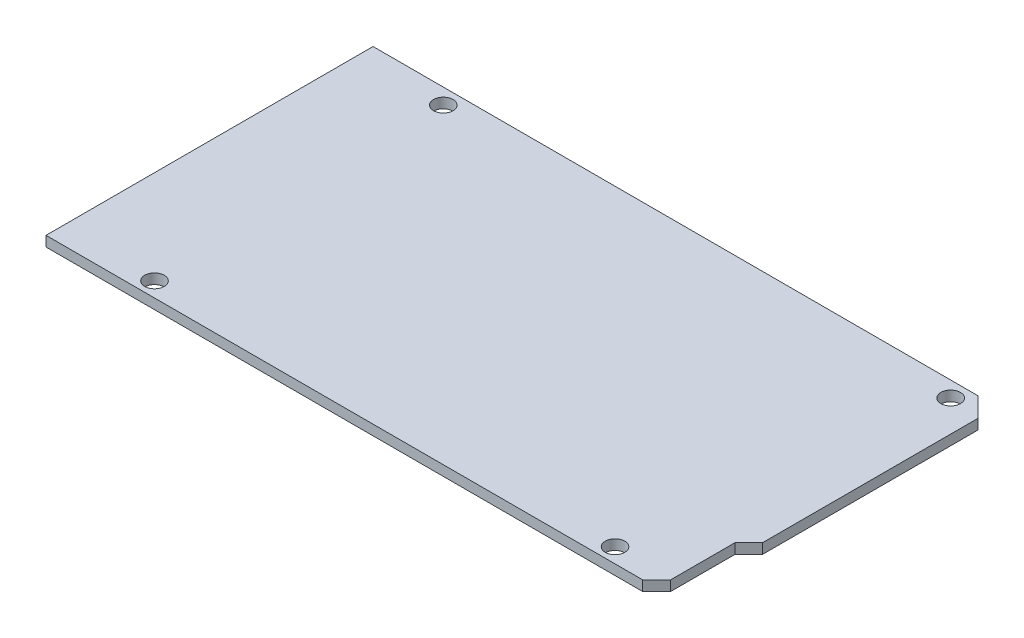
ISO-10303-21;
HEADER;
FILE_DESCRIPTION(('STEP AP214'),'2;1');
FILE_NAME('part.step','',(''),(''),'','','');
FILE_SCHEMA(('AUTOMOTIVE_DESIGN { 1 0 10303 214 1 1 1 1 }'));
ENDSEC;
DATA;
#1=APPLICATION_CONTEXT('core data for automotive mechanical design processes');
#2=APPLICATION_PROTOCOL_DEFINITION('international standard','automotive_design',2000,#1);
#3=PRODUCT_CONTEXT('',#1,'mechanical');
#4=PRODUCT('Part','Part','',(#3));
#5=PRODUCT_RELATED_PRODUCT_CATEGORY('part','',(#4));
#6=PRODUCT_DEFINITION_FORMATION('','',#4);
#7=PRODUCT_DEFINITION_CONTEXT('part definition',#1,'design');
#8=PRODUCT_DEFINITION('design','',#6,#7);
#9=PRODUCT_DEFINITION_SHAPE('','',#8);
#10=(LENGTH_UNIT() NAMED_UNIT(*) SI_UNIT(.MILLI.,.METRE.));
#11=(NAMED_UNIT(*) PLANE_ANGLE_UNIT() SI_UNIT($,.RADIAN.));
#12=(NAMED_UNIT(*) SI_UNIT($,.STERADIAN.) SOLID_ANGLE_UNIT());
#13=UNCERTAINTY_MEASURE_WITH_UNIT(LENGTH_MEASURE(1.E-05),#10,'distance_accuracy_value','');
#14=(GEOMETRIC_REPRESENTATION_CONTEXT(3) GLOBAL_UNCERTAINTY_ASSIGNED_CONTEXT((#13)) GLOBAL_UNIT_ASSIGNED_CONTEXT((#10,
#11,#12)) REPRESENTATION_CONTEXT('',''));
#15=CARTESIAN_POINT('',(0.,0.,0.));
#16=DIRECTION('',(0.,0.,1.));
#17=DIRECTION('',(1.,0.,0.));
#18=AXIS2_PLACEMENT_3D('',#15,#16,#17);
#19=CARTESIAN_POINT('',(0.,1.651,0.));
#20=DIRECTION('',(0.,-1.,0.));
#21=DIRECTION('',(0.,0.,-1.));
#22=AXIS2_PLACEMENT_3D('',#19,#20,#21);
#23=PLANE('',#22);
#24=CARTESIAN_POINT('',(39.37,1.651,24.1935));
#25=DIRECTION('',(0.,-1.,0.));
#26=DIRECTION('',(0.,0.,-1.));
#27=AXIS2_PLACEMENT_3D('',#24,#25,#26);
#28=CIRCLE('',#27,1.5875);
#29=CARTESIAN_POINT('',(39.37,1.651,22.606));
#30=VERTEX_POINT('',#29);
#31=EDGE_CURVE('E19',#30,#30,#28,.T.);
#32=ORIENTED_EDGE('',*,*,#31,.T.);
#33=EDGE_LOOP('',(#32));
#34=FACE_BOUND('',#33,.T.);
#35=CARTESIAN_POINT('',(45.72,1.651,-24.0665));
#36=DIRECTION('',(0.,-1.,0.));
#37=DIRECTION('',(0.,0.,-1.));
#38=AXIS2_PLACEMENT_3D('',#35,#36,#37);
#39=CIRCLE('',#38,1.5875);
#40=CARTESIAN_POINT('',(45.72,1.651,-25.654));
#41=VERTEX_POINT('',#40);
#42=EDGE_CURVE('E120',#41,#41,#39,.T.);
#43=ORIENTED_EDGE('',*,*,#42,.T.);
#44=EDGE_LOOP('',(#43));
#45=FACE_BOUND('',#44,.T.);
#46=CARTESIAN_POINT('',(-36.83,1.651,-24.0665));
#47=DIRECTION('',(0.,-1.,0.));
#48=DIRECTION('',(0.,0.,-1.));
#49=AXIS2_PLACEMENT_3D('',#46,#47,#48);
#50=CIRCLE('',#49,1.5875);
#51=CARTESIAN_POINT('',(-36.83,1.651,-25.654));
#52=VERTEX_POINT('',#51);
#53=EDGE_CURVE('E118',#52,#52,#50,.T.);
#54=ORIENTED_EDGE('',*,*,#53,.T.);
#55=EDGE_LOOP('',(#54));
#56=FACE_BOUND('',#55,.T.);
#57=CARTESIAN_POINT('',(-35.56,1.651,24.1935));
#58=DIRECTION('',(0.,-1.,0.));
#59=DIRECTION('',(0.,0.,-1.));
#60=AXIS2_PLACEMENT_3D('',#57,#58,#59);
#61=CIRCLE('',#60,1.5875);
#62=CARTESIAN_POINT('',(-35.56,1.651,22.606));
#63=VERTEX_POINT('',#62);
#64=EDGE_CURVE('E114',#63,#63,#61,.T.);
#65=ORIENTED_EDGE('',*,*,#64,.T.);
#66=EDGE_LOOP('',(#65));
#67=FACE_BOUND('',#66,.T.);
#68=DIRECTION('',(0.,0.,1.));
#69=VECTOR('',#68,1.);
#70=CARTESIAN_POINT('',(48.5548697692464,1.651,26.6065));
#71=LINE('',#70,#69);
#72=CARTESIAN_POINT('',(48.5548697692464,1.651,24.3205));
#73=VERTEX_POINT('',#72);
#74=CARTESIAN_POINT('',(48.5548697692464,1.651,13.8772331956146));
#75=VERTEX_POINT('',#74);
#76=EDGE_CURVE('E128',#73,#75,#71,.F.);
#77=ORIENTED_EDGE('',*,*,#76,.T.);
#78=DIRECTION('',(-0.707106781186549,0.,0.707106781186546));
#79=VECTOR('',#78,1.);
#80=CARTESIAN_POINT('',(48.5548697692464,1.651,13.8772331956146));
#81=LINE('',#80,#79);
#82=CARTESIAN_POINT('',(50.8,1.651,11.632102964861));
#83=VERTEX_POINT('',#82);
#84=EDGE_CURVE('E134',#75,#83,#81,.F.);
#85=ORIENTED_EDGE('',*,*,#84,.T.);
#86=DIRECTION('',(0.,0.,-1.));
#87=VECTOR('',#86,1.);
#88=CARTESIAN_POINT('',(50.8,1.651,26.6065));
#89=LINE('',#88,#87);
#90=CARTESIAN_POINT('',(50.8,1.651,-23.4315));
#91=VERTEX_POINT('',#90);
#92=EDGE_CURVE('E139',#91,#83,#89,.F.);
#93=ORIENTED_EDGE('',*,*,#92,.F.);
#94=DIRECTION('',(-0.707106781186546,0.,-0.707106781186549));
#95=VECTOR('',#94,1.);
#96=CARTESIAN_POINT('',(49.2125,1.651,-25.019));
#97=LINE('',#96,#95);
#98=CARTESIAN_POINT('',(47.625,1.651,-26.6065));
#99=VERTEX_POINT('',#98);
#100=EDGE_CURVE('E147',#99,#91,#97,.F.);
#101=ORIENTED_EDGE('',*,*,#100,.F.);
#102=DIRECTION('',(-1.,0.,0.));
#103=VECTOR('',#102,1.);
#104=CARTESIAN_POINT('',(50.8,1.651,-26.6065));
#105=LINE('',#104,#103);
#106=CARTESIAN_POINT('',(-50.8,1.651,-26.6065));
#107=VERTEX_POINT('',#106);
#108=EDGE_CURVE('E149',#107,#99,#105,.F.);
#109=ORIENTED_EDGE('',*,*,#108,.F.);
#110=DIRECTION('',(0.,0.,1.));
#111=VECTOR('',#110,1.);
#112=CARTESIAN_POINT('',(-50.8,1.651,-26.6065));
#113=LINE('',#112,#111);
#114=CARTESIAN_POINT('',(-50.8,1.651,26.6065));
#115=VERTEX_POINT('',#114);
#116=EDGE_CURVE('E94',#115,#107,#113,.F.);
#117=ORIENTED_EDGE('',*,*,#116,.F.);
#118=DIRECTION('',(1.,0.,0.));
#119=VECTOR('',#118,1.);
#120=CARTESIAN_POINT('',(-50.8,1.651,26.6065));
#121=LINE('',#120,#119);
#122=CARTESIAN_POINT('',(46.2688697692464,1.651,26.6065));
#123=VERTEX_POINT('',#122);
#124=EDGE_CURVE('E79',#123,#115,#121,.F.);
#125=ORIENTED_EDGE('',*,*,#124,.F.);
#126=DIRECTION('',(0.707106781186546,0.,-0.707106781186549));
#127=VECTOR('',#126,1.);
#128=CARTESIAN_POINT('',(47.4118697692464,1.651,25.4635));
#129=LINE('',#128,#127);
#130=EDGE_CURVE('E84',#73,#123,#129,.F.);
#131=ORIENTED_EDGE('',*,*,#130,.F.);
#132=EDGE_LOOP('',(#77,#85,#93,#101,#109,#117,#125,#131));
#133=FACE_BOUND('',#132,.T.);
#134=ADVANCED_FACE('F16',(#34,#45,#56,#67,#133),#23,.F.);
#135=CARTESIAN_POINT('',(47.4118697692464,0.8255,25.4635));
#136=DIRECTION('',(0.707106781186549,0.,0.707106781186546));
#137=DIRECTION('',(0.707106781186546,0.,-0.707106781186549));
#138=AXIS2_PLACEMENT_3D('',#135,#136,#137);
#139=PLANE('',#138);
#140=DIRECTION('',(-0.707106781186547,0.,0.707106781186547));
#141=VECTOR('',#140,1.);
#142=CARTESIAN_POINT('',(48.5548697692464,0.,24.3205));
#143=LINE('',#142,#141);
#144=CARTESIAN_POINT('',(48.5548697692464,0.,24.3205));
#145=VERTEX_POINT('',#144);
#146=CARTESIAN_POINT('',(46.2688697692464,0.,26.6065));
#147=VERTEX_POINT('',#146);
#148=EDGE_CURVE('E117',#145,#147,#143,.T.);
#149=ORIENTED_EDGE('',*,*,#148,.F.);
#150=DIRECTION('',(0.,1.,0.));
#151=VECTOR('',#150,1.);
#152=CARTESIAN_POINT('',(48.5548697692464,1.651,24.3205));
#153=LINE('',#152,#151);
#154=EDGE_CURVE('E89',#145,#73,#153,.T.);
#155=ORIENTED_EDGE('',*,*,#154,.T.);
#156=ORIENTED_EDGE('',*,*,#130,.T.);
#157=DIRECTION('',(0.,1.,0.));
#158=VECTOR('',#157,1.);
#159=CARTESIAN_POINT('',(46.2688697692464,0.,26.6065));
#160=LINE('',#159,#158);
#161=EDGE_CURVE('E86',#147,#123,#160,.T.);
#162=ORIENTED_EDGE('',*,*,#161,.F.);
#163=EDGE_LOOP('',(#149,#155,#156,#162));
#164=FACE_BOUND('',#163,.T.);
#165=ADVANCED_FACE('F85',(#164),#139,.T.);
#166=CARTESIAN_POINT('',(-50.8,0.,26.6065));
#167=DIRECTION('',(0.,0.,1.));
#168=DIRECTION('',(1.,0.,0.));
#169=AXIS2_PLACEMENT_3D('',#166,#167,#168);
#170=PLANE('',#169);
#171=DIRECTION('',(0.,1.,0.));
#172=VECTOR('',#171,1.);
#173=CARTESIAN_POINT('',(-50.8,0.,26.6065));
#174=LINE('',#173,#172);
#175=CARTESIAN_POINT('',(-50.8,0.,26.6065));
#176=VERTEX_POINT('',#175);
#177=EDGE_CURVE('E96',#176,#115,#174,.T.);
#178=ORIENTED_EDGE('',*,*,#177,.F.);
#179=DIRECTION('',(1.,0.,0.));
#180=VECTOR('',#179,1.);
#181=CARTESIAN_POINT('',(0.,0.,26.6065));
#182=LINE('',#181,#180);
#183=EDGE_CURVE('E100',#147,#176,#182,.F.);
#184=ORIENTED_EDGE('',*,*,#183,.F.);
#185=ORIENTED_EDGE('',*,*,#161,.T.);
#186=ORIENTED_EDGE('',*,*,#124,.T.);
#187=EDGE_LOOP('',(#178,#184,#185,#186));
#188=FACE_BOUND('',#187,.T.);
#189=ADVANCED_FACE('F98',(#188),#170,.T.);
#190=CARTESIAN_POINT('',(-50.8,0.,-26.6065));
#191=DIRECTION('',(-1.,0.,0.));
#192=DIRECTION('',(0.,0.,1.));
#193=AXIS2_PLACEMENT_3D('',#190,#191,#192);
#194=PLANE('',#193);
#195=ORIENTED_EDGE('',*,*,#116,.T.);
#196=DIRECTION('',(0.,1.,0.));
#197=VECTOR('',#196,1.);
#198=CARTESIAN_POINT('',(-50.8,0.,-26.6065));
#199=LINE('',#198,#197);
#200=CARTESIAN_POINT('',(-50.8,0.,-26.6065));
#201=VERTEX_POINT('',#200);
#202=EDGE_CURVE('E152',#201,#107,#199,.T.);
#203=ORIENTED_EDGE('',*,*,#202,.F.);
#204=DIRECTION('',(0.,0.,-1.));
#205=VECTOR('',#204,1.);
#206=CARTESIAN_POINT('',(-50.8,0.,0.));
#207=LINE('',#206,#205);
#208=EDGE_CURVE('E159',#176,#201,#207,.T.);
#209=ORIENTED_EDGE('',*,*,#208,.F.);
#210=ORIENTED_EDGE('',*,*,#177,.T.);
#211=EDGE_LOOP('',(#195,#203,#209,#210));
#212=FACE_BOUND('',#211,.T.);
#213=ADVANCED_FACE('F157',(#212),#194,.T.);
#214=CARTESIAN_POINT('',(50.8,0.,-26.6065));
#215=DIRECTION('',(0.,0.,-1.));
#216=DIRECTION('',(-1.,0.,0.));
#217=AXIS2_PLACEMENT_3D('',#214,#215,#216);
#218=PLANE('',#217);
#219=ORIENTED_EDGE('',*,*,#202,.T.);
#220=ORIENTED_EDGE('',*,*,#108,.T.);
#221=DIRECTION('',(0.,1.,0.));
#222=VECTOR('',#221,1.);
#223=CARTESIAN_POINT('',(47.625,0.,-26.6065));
#224=LINE('',#223,#222);
#225=CARTESIAN_POINT('',(47.625,0.,-26.6065));
#226=VERTEX_POINT('',#225);
#227=EDGE_CURVE('E144',#226,#99,#224,.T.);
#228=ORIENTED_EDGE('',*,*,#227,.F.);
#229=DIRECTION('',(1.,0.,0.));
#230=VECTOR('',#229,1.);
#231=CARTESIAN_POINT('',(0.,0.,-26.6065));
#232=LINE('',#231,#230);
#233=EDGE_CURVE('E163',#201,#226,#232,.T.);
#234=ORIENTED_EDGE('',*,*,#233,.F.);
#235=EDGE_LOOP('',(#219,#220,#228,#234));
#236=FACE_BOUND('',#235,.T.);
#237=ADVANCED_FACE('F188',(#236),#218,.T.);
#238=CARTESIAN_POINT('',(49.2125,0.,-25.019));
#239=DIRECTION('',(0.707106781186549,0.,-0.707106781186546));
#240=DIRECTION('',(-0.707106781186546,0.,-0.707106781186549));
#241=AXIS2_PLACEMENT_3D('',#238,#239,#240);
#242=PLANE('',#241);
#243=DIRECTION('',(0.707106781186547,0.,0.707106781186548));
#244=VECTOR('',#243,1.);
#245=CARTESIAN_POINT('',(47.625,0.,-26.6065));
#246=LINE('',#245,#244);
#247=CARTESIAN_POINT('',(50.8,0.,-23.4315));
#248=VERTEX_POINT('',#247);
#249=EDGE_CURVE('E170',#226,#248,#246,.T.);
#250=ORIENTED_EDGE('',*,*,#249,.F.);
#251=ORIENTED_EDGE('',*,*,#227,.T.);
#252=ORIENTED_EDGE('',*,*,#100,.T.);
#253=DIRECTION('',(0.,1.,0.));
#254=VECTOR('',#253,1.);
#255=CARTESIAN_POINT('',(50.8,0.,-23.4315));
#256=LINE('',#255,#254);
#257=EDGE_CURVE('E141',#248,#91,#256,.T.);
#258=ORIENTED_EDGE('',*,*,#257,.F.);
#259=EDGE_LOOP('',(#250,#251,#252,#258));
#260=FACE_BOUND('',#259,.T.);
#261=ADVANCED_FACE('F190',(#260),#242,.T.);
#262=CARTESIAN_POINT('',(50.8,0.,26.6065));
#263=DIRECTION('',(1.,0.,0.));
#264=DIRECTION('',(0.,0.,-1.));
#265=AXIS2_PLACEMENT_3D('',#262,#263,#264);
#266=PLANE('',#265);
#267=ORIENTED_EDGE('',*,*,#257,.T.);
#268=ORIENTED_EDGE('',*,*,#92,.T.);
#269=DIRECTION('',(0.,1.,0.));
#270=VECTOR('',#269,1.);
#271=CARTESIAN_POINT('',(50.8,1.651,11.632102964861));
#272=LINE('',#271,#270);
#273=CARTESIAN_POINT('',(50.8,0.,11.632102964861));
#274=VERTEX_POINT('',#273);
#275=EDGE_CURVE('E137',#83,#274,#272,.F.);
#276=ORIENTED_EDGE('',*,*,#275,.T.);
#277=DIRECTION('',(0.,0.,-1.));
#278=VECTOR('',#277,1.);
#279=CARTESIAN_POINT('',(50.8,0.,0.));
#280=LINE('',#279,#278);
#281=EDGE_CURVE('E173',#248,#274,#280,.F.);
#282=ORIENTED_EDGE('',*,*,#281,.F.);
#283=EDGE_LOOP('',(#267,#268,#276,#282));
#284=FACE_BOUND('',#283,.T.);
#285=ADVANCED_FACE('F185',(#284),#266,.T.);
#286=CARTESIAN_POINT('',(48.5548697692464,1.651,13.8772331956146));
#287=DIRECTION('',(-0.707106781186546,0.,-0.707106781186549));
#288=DIRECTION('',(-0.707106781186549,0.,0.707106781186546));
#289=AXIS2_PLACEMENT_3D('',#286,#287,#288);
#290=PLANE('',#289);
#291=DIRECTION('',(0.,1.,0.));
#292=VECTOR('',#291,1.);
#293=CARTESIAN_POINT('',(48.5548697692464,1.651,13.8772331956146));
#294=LINE('',#293,#292);
#295=CARTESIAN_POINT('',(48.5548697692464,0.,13.8772331956146));
#296=VERTEX_POINT('',#295);
#297=EDGE_CURVE('E34',#75,#296,#294,.F.);
#298=ORIENTED_EDGE('',*,*,#297,.T.);
#299=DIRECTION('',(-0.707106781186547,0.,0.707106781186547));
#300=VECTOR('',#299,1.);
#301=CARTESIAN_POINT('',(50.8,0.,11.632102964861));
#302=LINE('',#301,#300);
#303=EDGE_CURVE('E176',#274,#296,#302,.T.);
#304=ORIENTED_EDGE('',*,*,#303,.F.);
#305=ORIENTED_EDGE('',*,*,#275,.F.);
#306=ORIENTED_EDGE('',*,*,#84,.F.);
#307=EDGE_LOOP('',(#298,#304,#305,#306));
#308=FACE_BOUND('',#307,.T.);
#309=ADVANCED_FACE('F182',(#308),#290,.F.);
#310=CARTESIAN_POINT('',(48.5548697692464,1.651,26.6065));
#311=DIRECTION('',(-1.,0.,0.));
#312=DIRECTION('',(0.,0.,1.));
#313=AXIS2_PLACEMENT_3D('',#310,#311,#312);
#314=PLANE('',#313);
#315=DIRECTION('',(0.,0.,-1.));
#316=VECTOR('',#315,1.);
#317=CARTESIAN_POINT('',(48.5548697692464,0.,0.));
#318=LINE('',#317,#316);
#319=EDGE_CURVE('E113',#296,#145,#318,.F.);
#320=ORIENTED_EDGE('',*,*,#319,.F.);
#321=ORIENTED_EDGE('',*,*,#297,.F.);
#322=ORIENTED_EDGE('',*,*,#76,.F.);
#323=ORIENTED_EDGE('',*,*,#154,.F.);
#324=EDGE_LOOP('',(#320,#321,#322,#323));
#325=FACE_BOUND('',#324,.T.);
#326=ADVANCED_FACE('F179',(#325),#314,.F.);
#327=CARTESIAN_POINT('',(39.37,1.651,24.1935));
#328=DIRECTION('',(0.,-1.,0.));
#329=DIRECTION('',(0.,0.,-1.));
#330=AXIS2_PLACEMENT_3D('',#327,#328,#329);
#331=CYLINDRICAL_SURFACE('',#330,1.5875);
#332=ORIENTED_EDGE('',*,*,#31,.F.);
#333=EDGE_LOOP('',(#332));
#334=FACE_BOUND('',#333,.T.);
#335=CARTESIAN_POINT('',(39.37,0.,24.1935));
#336=DIRECTION('',(0.,-1.,0.));
#337=DIRECTION('',(0.,0.,-1.));
#338=AXIS2_PLACEMENT_3D('',#335,#336,#337);
#339=CIRCLE('',#338,1.5875);
#340=CARTESIAN_POINT('',(39.37,0.,22.606));
#341=VERTEX_POINT('',#340);
#342=EDGE_CURVE('E110',#341,#341,#339,.F.);
#343=ORIENTED_EDGE('',*,*,#342,.F.);
#344=EDGE_LOOP('',(#343));
#345=FACE_BOUND('',#344,.T.);
#346=ADVANCED_FACE('F218',(#334,#345),#331,.F.);
#347=CARTESIAN_POINT('',(45.72,1.651,-24.0665));
#348=DIRECTION('',(0.,-1.,0.));
#349=DIRECTION('',(0.,0.,-1.));
#350=AXIS2_PLACEMENT_3D('',#347,#348,#349);
#351=CYLINDRICAL_SURFACE('',#350,1.5875);
#352=ORIENTED_EDGE('',*,*,#42,.F.);
#353=EDGE_LOOP('',(#352));
#354=FACE_BOUND('',#353,.T.);
#355=CARTESIAN_POINT('',(45.72,0.,-24.0665));
#356=DIRECTION('',(0.,-1.,0.));
#357=DIRECTION('',(0.,0.,-1.));
#358=AXIS2_PLACEMENT_3D('',#355,#356,#357);
#359=CIRCLE('',#358,1.5875);
#360=CARTESIAN_POINT('',(45.72,0.,-25.654));
#361=VERTEX_POINT('',#360);
#362=EDGE_CURVE('E107',#361,#361,#359,.F.);
#363=ORIENTED_EDGE('',*,*,#362,.F.);
#364=EDGE_LOOP('',(#363));
#365=FACE_BOUND('',#364,.T.);
#366=ADVANCED_FACE('F214',(#354,#365),#351,.F.);
#367=CARTESIAN_POINT('',(-36.83,1.651,-24.0665));
#368=DIRECTION('',(0.,-1.,0.));
#369=DIRECTION('',(0.,0.,-1.));
#370=AXIS2_PLACEMENT_3D('',#367,#368,#369);
#371=CYLINDRICAL_SURFACE('',#370,1.5875);
#372=ORIENTED_EDGE('',*,*,#53,.F.);
#373=EDGE_LOOP('',(#372));
#374=FACE_BOUND('',#373,.T.);
#375=CARTESIAN_POINT('',(-36.83,0.,-24.0665));
#376=DIRECTION('',(0.,-1.,0.));
#377=DIRECTION('',(0.,0.,-1.));
#378=AXIS2_PLACEMENT_3D('',#375,#376,#377);
#379=CIRCLE('',#378,1.5875);
#380=CARTESIAN_POINT('',(-36.83,0.,-25.654));
#381=VERTEX_POINT('',#380);
#382=EDGE_CURVE('E25',#381,#381,#379,.F.);
#383=ORIENTED_EDGE('',*,*,#382,.F.);
#384=EDGE_LOOP('',(#383));
#385=FACE_BOUND('',#384,.T.);
#386=ADVANCED_FACE('F207',(#374,#385),#371,.F.);
#387=CARTESIAN_POINT('',(-35.56,1.651,24.1935));
#388=DIRECTION('',(0.,-1.,0.));
#389=DIRECTION('',(0.,0.,-1.));
#390=AXIS2_PLACEMENT_3D('',#387,#388,#389);
#391=CYLINDRICAL_SURFACE('',#390,1.5875);
#392=ORIENTED_EDGE('',*,*,#64,.F.);
#393=EDGE_LOOP('',(#392));
#394=FACE_BOUND('',#393,.T.);
#395=CARTESIAN_POINT('',(-35.56,0.,24.1935));
#396=DIRECTION('',(0.,-1.,0.));
#397=DIRECTION('',(0.,0.,-1.));
#398=AXIS2_PLACEMENT_3D('',#395,#396,#397);
#399=CIRCLE('',#398,1.5875);
#400=CARTESIAN_POINT('',(-35.56,0.,22.606));
#401=VERTEX_POINT('',#400);
#402=EDGE_CURVE('E10',#401,#401,#399,.F.);
#403=ORIENTED_EDGE('',*,*,#402,.F.);
#404=EDGE_LOOP('',(#403));
#405=FACE_BOUND('',#404,.T.);
#406=ADVANCED_FACE('F201',(#394,#405),#391,.F.);
#407=CARTESIAN_POINT('',(0.,0.,0.));
#408=DIRECTION('',(0.,-1.,0.));
#409=DIRECTION('',(0.,0.,-1.));
#410=AXIS2_PLACEMENT_3D('',#407,#408,#409);
#411=PLANE('',#410);
#412=ORIENTED_EDGE('',*,*,#402,.T.);
#413=EDGE_LOOP('',(#412));
#414=FACE_BOUND('',#413,.T.);
#415=ORIENTED_EDGE('',*,*,#382,.T.);
#416=EDGE_LOOP('',(#415));
#417=FACE_BOUND('',#416,.T.);
#418=ORIENTED_EDGE('',*,*,#362,.T.);
#419=EDGE_LOOP('',(#418));
#420=FACE_BOUND('',#419,.T.);
#421=ORIENTED_EDGE('',*,*,#342,.T.);
#422=EDGE_LOOP('',(#421));
#423=FACE_BOUND('',#422,.T.);
#424=ORIENTED_EDGE('',*,*,#303,.T.);
#425=ORIENTED_EDGE('',*,*,#319,.T.);
#426=ORIENTED_EDGE('',*,*,#148,.T.);
#427=ORIENTED_EDGE('',*,*,#183,.T.);
#428=ORIENTED_EDGE('',*,*,#208,.T.);
#429=ORIENTED_EDGE('',*,*,#233,.T.);
#430=ORIENTED_EDGE('',*,*,#249,.T.);
#431=ORIENTED_EDGE('',*,*,#281,.T.);
#432=EDGE_LOOP('',(#424,#425,#426,#427,#428,#429,#430,#431));
#433=FACE_BOUND('',#432,.T.);
#434=ADVANCED_FACE('F166',(#414,#417,#420,#423,#433),#411,.T.);
#435=CLOSED_SHELL('',(#134,#165,#189,#213,#237,#261,#285,#309,#326,#346,#366,#386,#406,#434));
#436=MANIFOLD_SOLID_BREP('B1',#435);
#437=ADVANCED_BREP_SHAPE_REPRESENTATION('',(#18,#436),#14);
#438=SHAPE_DEFINITION_REPRESENTATION(#9,#437);
ENDSEC;
END-ISO-10303-21;
